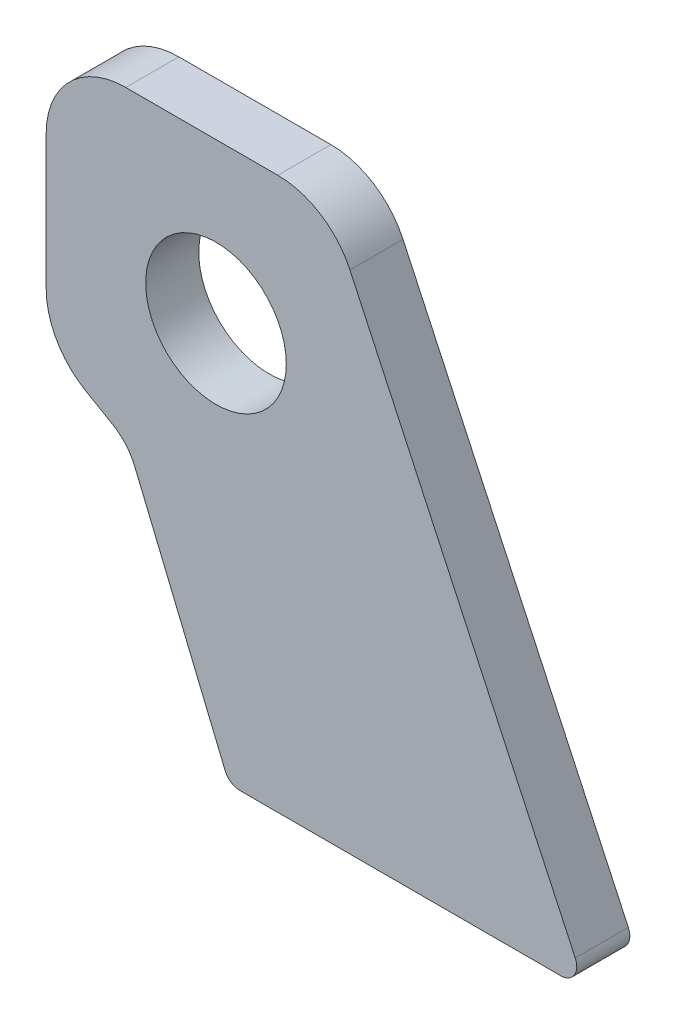
ISO-10303-21;
HEADER;
FILE_DESCRIPTION(('STEP AP214'),'2;1');
FILE_NAME('part.step','',(''),(''),'','','');
FILE_SCHEMA(('AUTOMOTIVE_DESIGN { 1 0 10303 214 1 1 1 1 }'));
ENDSEC;
DATA;
#1=APPLICATION_CONTEXT('core data for automotive mechanical design processes');
#2=APPLICATION_PROTOCOL_DEFINITION('international standard','automotive_design',2000,#1);
#3=PRODUCT_CONTEXT('',#1,'mechanical');
#4=PRODUCT('Part','Part','',(#3));
#5=PRODUCT_RELATED_PRODUCT_CATEGORY('part','',(#4));
#6=PRODUCT_DEFINITION_FORMATION('','',#4);
#7=PRODUCT_DEFINITION_CONTEXT('part definition',#1,'design');
#8=PRODUCT_DEFINITION('design','',#6,#7);
#9=PRODUCT_DEFINITION_SHAPE('','',#8);
#10=(LENGTH_UNIT() NAMED_UNIT(*) SI_UNIT(.MILLI.,.METRE.));
#11=(NAMED_UNIT(*) PLANE_ANGLE_UNIT() SI_UNIT($,.RADIAN.));
#12=(NAMED_UNIT(*) SI_UNIT($,.STERADIAN.) SOLID_ANGLE_UNIT());
#13=UNCERTAINTY_MEASURE_WITH_UNIT(LENGTH_MEASURE(1.E-05),#10,'distance_accuracy_value','');
#14=(GEOMETRIC_REPRESENTATION_CONTEXT(3) GLOBAL_UNCERTAINTY_ASSIGNED_CONTEXT((#13)) GLOBAL_UNIT_ASSIGNED_CONTEXT((#10,
#11,#12)) REPRESENTATION_CONTEXT('',''));
#15=CARTESIAN_POINT('',(0.,0.,0.));
#16=DIRECTION('',(0.,0.,1.));
#17=DIRECTION('',(1.,0.,0.));
#18=AXIS2_PLACEMENT_3D('',#15,#16,#17);
#19=CARTESIAN_POINT('',(-17.,14.9999999930106,10.));
#20=DIRECTION('',(0.,0.,1.));
#21=DIRECTION('',(1.,0.,0.));
#22=AXIS2_PLACEMENT_3D('',#19,#20,#21);
#23=PLANE('',#22);
#24=CARTESIAN_POINT('',(-17.,14.9999999930106,10.));
#25=DIRECTION('',(0.,0.,1.));
#26=DIRECTION('',(1.,0.,0.));
#27=AXIS2_PLACEMENT_3D('',#24,#25,#26);
#28=CIRCLE('',#27,15.);
#29=CARTESIAN_POINT('',(-17.,29.9999999930105,10.));
#30=VERTEX_POINT('',#29);
#31=CARTESIAN_POINT('',(-32.,14.9999999930106,10.));
#32=VERTEX_POINT('',#31);
#33=EDGE_CURVE('E183',#30,#32,#28,.T.);
#34=ORIENTED_EDGE('',*,*,#33,.T.);
#35=DIRECTION('',(0.,-1.,0.));
#36=VECTOR('',#35,1.);
#37=CARTESIAN_POINT('',(-32.,-10.339745969145,10.));
#38=LINE('',#37,#36);
#39=CARTESIAN_POINT('',(-32.,-10.339745969145,10.));
#40=VERTEX_POINT('',#39);
#41=EDGE_CURVE('E111',#32,#40,#38,.T.);
#42=ORIENTED_EDGE('',*,*,#41,.T.);
#43=CARTESIAN_POINT('',(-17.,-10.339745969145,10.));
#44=DIRECTION('',(0.,0.,1.));
#45=DIRECTION('',(-1.,0.,0.));
#46=AXIS2_PLACEMENT_3D('',#43,#44,#45);
#47=CIRCLE('',#46,15.);
#48=CARTESIAN_POINT('',(-24.5,-23.3301270259116,10.));
#49=VERTEX_POINT('',#48);
#50=EDGE_CURVE('E210',#40,#49,#47,.T.);
#51=ORIENTED_EDGE('',*,*,#50,.T.);
#52=DIRECTION('',(0.86602540378444,-0.499999999999997,0.));
#53=VECTOR('',#52,1.);
#54=CARTESIAN_POINT('',(-19.5383048123464,-26.1947630781402,10.));
#55=LINE('',#54,#53);
#56=CARTESIAN_POINT('',(-19.5383048123464,-26.1947630781403,10.));
#57=VERTEX_POINT('',#56);
#58=EDGE_CURVE('E229',#49,#57,#55,.T.);
#59=ORIENTED_EDGE('',*,*,#58,.T.);
#60=CARTESIAN_POINT('',(-24.5383048123464,-34.8550171159847,10.));
#61=DIRECTION('',(0.,0.,-1.));
#62=DIRECTION('',(-1.,0.,0.));
#63=AXIS2_PLACEMENT_3D('',#60,#61,#62);
#64=CIRCLE('',#63,10.);
#65=CARTESIAN_POINT('',(-15.2995094872336,-31.0281827923336,10.));
#66=VERTEX_POINT('',#65);
#67=EDGE_CURVE('E226',#57,#66,#64,.T.);
#68=ORIENTED_EDGE('',*,*,#67,.T.);
#69=DIRECTION('',(0.382683432365102,-0.923879532511282,0.));
#70=VECTOR('',#69,1.);
#71=CARTESIAN_POINT('',(1.73289731622402,-72.1480502970953,10.));
#72=LINE('',#71,#70);
#73=CARTESIAN_POINT('',(1.73289731622403,-72.1480502970953,10.));
#74=VERTEX_POINT('',#73);
#75=EDGE_CURVE('E228',#66,#74,#72,.T.);
#76=ORIENTED_EDGE('',*,*,#75,.T.);
#77=CARTESIAN_POINT('',(4.5045359137579,-71.,10.));
#78=DIRECTION('',(0.,0.,1.));
#79=DIRECTION('',(-1.,0.,0.));
#80=AXIS2_PLACEMENT_3D('',#77,#78,#79);
#81=CIRCLE('',#80,3.00000000000003);
#82=CARTESIAN_POINT('',(4.50453591375787,-74.,10.));
#83=VERTEX_POINT('',#82);
#84=EDGE_CURVE('E231',#74,#83,#81,.T.);
#85=ORIENTED_EDGE('',*,*,#84,.T.);
#86=DIRECTION('',(1.,0.,0.));
#87=VECTOR('',#86,1.);
#88=CARTESIAN_POINT('',(65.,-74.,10.));
#89=LINE('',#88,#87);
#90=CARTESIAN_POINT('',(65.,-74.,10.));
#91=VERTEX_POINT('',#90);
#92=EDGE_CURVE('E237',#83,#91,#89,.T.);
#93=ORIENTED_EDGE('',*,*,#92,.T.);
#94=CARTESIAN_POINT('',(65.,-71.,10.));
#95=DIRECTION('',(0.,0.,1.));
#96=DIRECTION('',(-1.,0.,0.));
#97=AXIS2_PLACEMENT_3D('',#94,#95,#96);
#98=CIRCLE('',#97,2.99999999999999);
#99=CARTESIAN_POINT('',(67.7189233611099,-69.7321452147779,10.));
#100=VERTEX_POINT('',#99);
#101=EDGE_CURVE('E142',#91,#100,#98,.T.);
#102=ORIENTED_EDGE('',*,*,#101,.T.);
#103=DIRECTION('',(-0.422618261740704,0.906307787036648,0.));
#104=VECTOR('',#103,1.);
#105=CARTESIAN_POINT('',(25.2516231799286,21.3392739191211,10.));
#106=LINE('',#105,#104);
#107=CARTESIAN_POINT('',(25.2516231799286,21.3392739191211,10.));
#108=VERTEX_POINT('',#107);
#109=EDGE_CURVE('E136',#100,#108,#106,.T.);
#110=ORIENTED_EDGE('',*,*,#109,.T.);
#111=CARTESIAN_POINT('',(11.6570063743789,14.9999999930106,10.));
#112=DIRECTION('',(0.,0.,1.));
#113=DIRECTION('',(-1.,0.,0.));
#114=AXIS2_PLACEMENT_3D('',#111,#112,#113);
#115=CIRCLE('',#114,15.);
#116=CARTESIAN_POINT('',(11.6570063743789,29.9999999930105,10.));
#117=VERTEX_POINT('',#116);
#118=EDGE_CURVE('E140',#108,#117,#115,.T.);
#119=ORIENTED_EDGE('',*,*,#118,.T.);
#120=DIRECTION('',(-1.,0.,0.));
#121=VECTOR('',#120,1.);
#122=CARTESIAN_POINT('',(-17.,29.9999999930105,10.));
#123=LINE('',#122,#121);
#124=EDGE_CURVE('E56',#117,#30,#123,.T.);
#125=ORIENTED_EDGE('',*,*,#124,.T.);
#126=EDGE_LOOP('',(#34,#42,#51,#59,#68,#76,#85,#93,#102,#110,#119,#125));
#127=FACE_BOUND('',#126,.T.);
#128=CARTESIAN_POINT('',(0.,0.,10.));
#129=DIRECTION('',(0.,0.,1.));
#130=DIRECTION('',(1.,0.,0.));
#131=AXIS2_PLACEMENT_3D('',#128,#129,#130);
#132=CIRCLE('',#131,13.25);
#133=CARTESIAN_POINT('',(13.25,0.,10.));
#134=VERTEX_POINT('',#133);
#135=EDGE_CURVE('E164',#134,#134,#132,.T.);
#136=ORIENTED_EDGE('',*,*,#135,.F.);
#137=EDGE_LOOP('',(#136));
#138=FACE_BOUND('',#137,.T.);
#139=ADVANCED_FACE('F39',(#127,#138),#23,.T.);
#140=CARTESIAN_POINT('',(-17.,14.9999999930106,0.));
#141=DIRECTION('',(0.,0.,1.));
#142=DIRECTION('',(1.,0.,0.));
#143=AXIS2_PLACEMENT_3D('',#140,#141,#142);
#144=PLANE('',#143);
#145=CARTESIAN_POINT('',(-17.,14.9999999930106,0.));
#146=DIRECTION('',(0.,0.,1.));
#147=DIRECTION('',(1.,0.,0.));
#148=AXIS2_PLACEMENT_3D('',#145,#146,#147);
#149=CIRCLE('',#148,15.);
#150=CARTESIAN_POINT('',(-17.,29.9999999930105,0.));
#151=VERTEX_POINT('',#150);
#152=CARTESIAN_POINT('',(-32.,14.9999999930106,0.));
#153=VERTEX_POINT('',#152);
#154=EDGE_CURVE('E160',#151,#153,#149,.T.);
#155=ORIENTED_EDGE('',*,*,#154,.F.);
#156=DIRECTION('',(-1.,0.,0.));
#157=VECTOR('',#156,1.);
#158=CARTESIAN_POINT('',(-17.,29.9999999930105,0.));
#159=LINE('',#158,#157);
#160=CARTESIAN_POINT('',(11.6570063743789,29.9999999930105,0.));
#161=VERTEX_POINT('',#160);
#162=EDGE_CURVE('E103',#161,#151,#159,.T.);
#163=ORIENTED_EDGE('',*,*,#162,.F.);
#164=CARTESIAN_POINT('',(11.6570063743789,14.9999999930106,0.));
#165=DIRECTION('',(0.,0.,1.));
#166=DIRECTION('',(-1.,0.,0.));
#167=AXIS2_PLACEMENT_3D('',#164,#165,#166);
#168=CIRCLE('',#167,15.);
#169=CARTESIAN_POINT('',(25.2516231799286,21.3392739191211,0.));
#170=VERTEX_POINT('',#169);
#171=EDGE_CURVE('E97',#170,#161,#168,.T.);
#172=ORIENTED_EDGE('',*,*,#171,.F.);
#173=DIRECTION('',(-0.422618261740704,0.906307787036648,0.));
#174=VECTOR('',#173,1.);
#175=CARTESIAN_POINT('',(25.2516231799286,21.3392739191211,0.));
#176=LINE('',#175,#174);
#177=CARTESIAN_POINT('',(67.7189233611099,-69.7321452147779,0.));
#178=VERTEX_POINT('',#177);
#179=EDGE_CURVE('E150',#178,#170,#176,.T.);
#180=ORIENTED_EDGE('',*,*,#179,.F.);
#181=CARTESIAN_POINT('',(65.,-71.,0.));
#182=DIRECTION('',(0.,0.,1.));
#183=DIRECTION('',(-1.,0.,0.));
#184=AXIS2_PLACEMENT_3D('',#181,#182,#183);
#185=CIRCLE('',#184,2.99999999999999);
#186=CARTESIAN_POINT('',(65.,-74.,0.));
#187=VERTEX_POINT('',#186);
#188=EDGE_CURVE('E178',#187,#178,#185,.T.);
#189=ORIENTED_EDGE('',*,*,#188,.F.);
#190=DIRECTION('',(1.,0.,0.));
#191=VECTOR('',#190,1.);
#192=CARTESIAN_POINT('',(65.,-74.,0.));
#193=LINE('',#192,#191);
#194=CARTESIAN_POINT('',(4.50453591375787,-74.,0.));
#195=VERTEX_POINT('',#194);
#196=EDGE_CURVE('E176',#195,#187,#193,.T.);
#197=ORIENTED_EDGE('',*,*,#196,.F.);
#198=CARTESIAN_POINT('',(4.5045359137579,-71.,0.));
#199=DIRECTION('',(0.,0.,1.));
#200=DIRECTION('',(-1.,0.,0.));
#201=AXIS2_PLACEMENT_3D('',#198,#199,#200);
#202=CIRCLE('',#201,3.00000000000003);
#203=CARTESIAN_POINT('',(1.73289731622403,-72.1480502970953,0.));
#204=VERTEX_POINT('',#203);
#205=EDGE_CURVE('E174',#204,#195,#202,.T.);
#206=ORIENTED_EDGE('',*,*,#205,.F.);
#207=DIRECTION('',(0.382683432365102,-0.923879532511282,0.));
#208=VECTOR('',#207,1.);
#209=CARTESIAN_POINT('',(1.73289731622402,-72.1480502970953,0.));
#210=LINE('',#209,#208);
#211=CARTESIAN_POINT('',(-15.2995094872336,-31.0281827923336,0.));
#212=VERTEX_POINT('',#211);
#213=EDGE_CURVE('E172',#212,#204,#210,.T.);
#214=ORIENTED_EDGE('',*,*,#213,.F.);
#215=CARTESIAN_POINT('',(-24.5383048123464,-34.8550171159847,0.));
#216=DIRECTION('',(0.,0.,-1.));
#217=DIRECTION('',(-1.,0.,0.));
#218=AXIS2_PLACEMENT_3D('',#215,#216,#217);
#219=CIRCLE('',#218,10.);
#220=CARTESIAN_POINT('',(-19.5383048123464,-26.1947630781403,0.));
#221=VERTEX_POINT('',#220);
#222=EDGE_CURVE('E170',#221,#212,#219,.T.);
#223=ORIENTED_EDGE('',*,*,#222,.F.);
#224=DIRECTION('',(0.86602540378444,-0.499999999999997,0.));
#225=VECTOR('',#224,1.);
#226=CARTESIAN_POINT('',(-19.5383048123464,-26.1947630781402,0.));
#227=LINE('',#226,#225);
#228=CARTESIAN_POINT('',(-24.5,-23.3301270259116,0.));
#229=VERTEX_POINT('',#228);
#230=EDGE_CURVE('E168',#229,#221,#227,.T.);
#231=ORIENTED_EDGE('',*,*,#230,.F.);
#232=CARTESIAN_POINT('',(-17.,-10.339745969145,0.));
#233=DIRECTION('',(0.,0.,1.));
#234=DIRECTION('',(-1.,0.,0.));
#235=AXIS2_PLACEMENT_3D('',#232,#233,#234);
#236=CIRCLE('',#235,15.);
#237=CARTESIAN_POINT('',(-32.,-10.339745969145,0.));
#238=VERTEX_POINT('',#237);
#239=EDGE_CURVE('E166',#238,#229,#236,.T.);
#240=ORIENTED_EDGE('',*,*,#239,.F.);
#241=DIRECTION('',(0.,-1.,0.));
#242=VECTOR('',#241,1.);
#243=CARTESIAN_POINT('',(-32.,-10.339745969145,0.));
#244=LINE('',#243,#242);
#245=EDGE_CURVE('E163',#153,#238,#244,.T.);
#246=ORIENTED_EDGE('',*,*,#245,.F.);
#247=EDGE_LOOP('',(#155,#163,#172,#180,#189,#197,#206,#214,#223,#231,#240,#246));
#248=FACE_BOUND('',#247,.T.);
#249=CARTESIAN_POINT('',(0.,0.,0.));
#250=DIRECTION('',(0.,0.,1.));
#251=DIRECTION('',(1.,0.,0.));
#252=AXIS2_PLACEMENT_3D('',#249,#250,#251);
#253=CIRCLE('',#252,13.25);
#254=CARTESIAN_POINT('',(13.25,0.,0.));
#255=VERTEX_POINT('',#254);
#256=EDGE_CURVE('E354',#255,#255,#253,.T.);
#257=ORIENTED_EDGE('',*,*,#256,.T.);
#258=EDGE_LOOP('',(#257));
#259=FACE_BOUND('',#258,.T.);
#260=ADVANCED_FACE('F214',(#248,#259),#144,.F.);
#261=CARTESIAN_POINT('',(-17.,14.9999999930106,10.));
#262=DIRECTION('',(0.,0.,-1.));
#263=DIRECTION('',(-1.,0.,0.));
#264=AXIS2_PLACEMENT_3D('',#261,#262,#263);
#265=CYLINDRICAL_SURFACE('',#264,15.);
#266=ORIENTED_EDGE('',*,*,#154,.T.);
#267=DIRECTION('',(0.,0.,-1.));
#268=VECTOR('',#267,1.);
#269=CARTESIAN_POINT('',(-32.,14.9999999930106,10.));
#270=LINE('',#269,#268);
#271=EDGE_CURVE('E11',#32,#153,#270,.T.);
#272=ORIENTED_EDGE('',*,*,#271,.F.);
#273=ORIENTED_EDGE('',*,*,#33,.F.);
#274=DIRECTION('',(0.,0.,-1.));
#275=VECTOR('',#274,1.);
#276=CARTESIAN_POINT('',(-17.,29.9999999930105,10.));
#277=LINE('',#276,#275);
#278=EDGE_CURVE('E156',#30,#151,#277,.T.);
#279=ORIENTED_EDGE('',*,*,#278,.T.);
#280=EDGE_LOOP('',(#266,#272,#273,#279));
#281=FACE_BOUND('',#280,.T.);
#282=ADVANCED_FACE('F41',(#281),#265,.T.);
#283=CARTESIAN_POINT('',(-32.,-10.339745969145,10.));
#284=DIRECTION('',(1.,0.,0.));
#285=DIRECTION('',(0.,1.,0.));
#286=AXIS2_PLACEMENT_3D('',#283,#284,#285);
#287=PLANE('',#286);
#288=ORIENTED_EDGE('',*,*,#245,.T.);
#289=DIRECTION('',(0.,0.,-1.));
#290=VECTOR('',#289,1.);
#291=CARTESIAN_POINT('',(-32.,-10.339745969145,10.));
#292=LINE('',#291,#290);
#293=EDGE_CURVE('E48',#40,#238,#292,.T.);
#294=ORIENTED_EDGE('',*,*,#293,.F.);
#295=ORIENTED_EDGE('',*,*,#41,.F.);
#296=ORIENTED_EDGE('',*,*,#271,.T.);
#297=EDGE_LOOP('',(#288,#294,#295,#296));
#298=FACE_BOUND('',#297,.T.);
#299=ADVANCED_FACE('F271',(#298),#287,.F.);
#300=CARTESIAN_POINT('',(-17.,-10.339745969145,10.));
#301=DIRECTION('',(0.,0.,-1.));
#302=DIRECTION('',(-1.,0.,0.));
#303=AXIS2_PLACEMENT_3D('',#300,#301,#302);
#304=CYLINDRICAL_SURFACE('',#303,15.);
#305=ORIENTED_EDGE('',*,*,#239,.T.);
#306=DIRECTION('',(0.,0.,-1.));
#307=VECTOR('',#306,1.);
#308=CARTESIAN_POINT('',(-24.5,-23.3301270259116,10.));
#309=LINE('',#308,#307);
#310=EDGE_CURVE('E202',#49,#229,#309,.T.);
#311=ORIENTED_EDGE('',*,*,#310,.F.);
#312=ORIENTED_EDGE('',*,*,#50,.F.);
#313=ORIENTED_EDGE('',*,*,#293,.T.);
#314=EDGE_LOOP('',(#305,#311,#312,#313));
#315=FACE_BOUND('',#314,.T.);
#316=ADVANCED_FACE('F208',(#315),#304,.T.);
#317=CARTESIAN_POINT('',(-19.5383048123464,-26.1947630781402,10.));
#318=DIRECTION('',(0.499999999999997,0.86602540378444,0.));
#319=DIRECTION('',(-0.86602540378444,0.499999999999997,0.));
#320=AXIS2_PLACEMENT_3D('',#317,#318,#319);
#321=PLANE('',#320);
#322=ORIENTED_EDGE('',*,*,#230,.T.);
#323=DIRECTION('',(0.,0.,-1.));
#324=VECTOR('',#323,1.);
#325=CARTESIAN_POINT('',(-19.5383048123464,-26.1947630781403,10.));
#326=LINE('',#325,#324);
#327=EDGE_CURVE('E199',#57,#221,#326,.T.);
#328=ORIENTED_EDGE('',*,*,#327,.F.);
#329=ORIENTED_EDGE('',*,*,#58,.F.);
#330=ORIENTED_EDGE('',*,*,#310,.T.);
#331=EDGE_LOOP('',(#322,#328,#329,#330));
#332=FACE_BOUND('',#331,.T.);
#333=ADVANCED_FACE('F220',(#332),#321,.F.);
#334=CARTESIAN_POINT('',(-24.5383048123464,-34.8550171159847,10.));
#335=DIRECTION('',(0.,0.,-1.));
#336=DIRECTION('',(-1.,0.,0.));
#337=AXIS2_PLACEMENT_3D('',#334,#335,#336);
#338=CYLINDRICAL_SURFACE('',#337,10.);
#339=ORIENTED_EDGE('',*,*,#222,.T.);
#340=DIRECTION('',(0.,0.,-1.));
#341=VECTOR('',#340,1.);
#342=CARTESIAN_POINT('',(-15.2995094872336,-31.0281827923336,10.));
#343=LINE('',#342,#341);
#344=EDGE_CURVE('E196',#66,#212,#343,.T.);
#345=ORIENTED_EDGE('',*,*,#344,.F.);
#346=ORIENTED_EDGE('',*,*,#67,.F.);
#347=ORIENTED_EDGE('',*,*,#327,.T.);
#348=EDGE_LOOP('',(#339,#345,#346,#347));
#349=FACE_BOUND('',#348,.T.);
#350=ADVANCED_FACE('F224',(#349),#338,.F.);
#351=CARTESIAN_POINT('',(1.73289731622402,-72.1480502970953,10.));
#352=DIRECTION('',(0.923879532511282,0.382683432365102,0.));
#353=DIRECTION('',(-0.382683432365102,0.923879532511282,0.));
#354=AXIS2_PLACEMENT_3D('',#351,#352,#353);
#355=PLANE('',#354);
#356=ORIENTED_EDGE('',*,*,#213,.T.);
#357=DIRECTION('',(0.,0.,-1.));
#358=VECTOR('',#357,1.);
#359=CARTESIAN_POINT('',(1.73289731622403,-72.1480502970953,10.));
#360=LINE('',#359,#358);
#361=EDGE_CURVE('E193',#74,#204,#360,.T.);
#362=ORIENTED_EDGE('',*,*,#361,.F.);
#363=ORIENTED_EDGE('',*,*,#75,.F.);
#364=ORIENTED_EDGE('',*,*,#344,.T.);
#365=EDGE_LOOP('',(#356,#362,#363,#364));
#366=FACE_BOUND('',#365,.T.);
#367=ADVANCED_FACE('F284',(#366),#355,.F.);
#368=CARTESIAN_POINT('',(4.5045359137579,-71.,10.));
#369=DIRECTION('',(0.,0.,-1.));
#370=DIRECTION('',(-1.,0.,0.));
#371=AXIS2_PLACEMENT_3D('',#368,#369,#370);
#372=CYLINDRICAL_SURFACE('',#371,3.00000000000003);
#373=ORIENTED_EDGE('',*,*,#205,.T.);
#374=DIRECTION('',(0.,0.,-1.));
#375=VECTOR('',#374,1.);
#376=CARTESIAN_POINT('',(4.50453591375787,-74.,10.));
#377=LINE('',#376,#375);
#378=EDGE_CURVE('E190',#83,#195,#377,.T.);
#379=ORIENTED_EDGE('',*,*,#378,.F.);
#380=ORIENTED_EDGE('',*,*,#84,.F.);
#381=ORIENTED_EDGE('',*,*,#361,.T.);
#382=EDGE_LOOP('',(#373,#379,#380,#381));
#383=FACE_BOUND('',#382,.T.);
#384=ADVANCED_FACE('F287',(#383),#372,.T.);
#385=CARTESIAN_POINT('',(65.,-74.,10.));
#386=DIRECTION('',(0.,1.,0.));
#387=DIRECTION('',(-1.,0.,0.));
#388=AXIS2_PLACEMENT_3D('',#385,#386,#387);
#389=PLANE('',#388);
#390=ORIENTED_EDGE('',*,*,#196,.T.);
#391=DIRECTION('',(0.,0.,-1.));
#392=VECTOR('',#391,1.);
#393=CARTESIAN_POINT('',(65.,-74.,10.));
#394=LINE('',#393,#392);
#395=EDGE_CURVE('E187',#91,#187,#394,.T.);
#396=ORIENTED_EDGE('',*,*,#395,.F.);
#397=ORIENTED_EDGE('',*,*,#92,.F.);
#398=ORIENTED_EDGE('',*,*,#378,.T.);
#399=EDGE_LOOP('',(#390,#396,#397,#398));
#400=FACE_BOUND('',#399,.T.);
#401=ADVANCED_FACE('F243',(#400),#389,.F.);
#402=CARTESIAN_POINT('',(65.,-71.,10.));
#403=DIRECTION('',(0.,0.,-1.));
#404=DIRECTION('',(-1.,0.,0.));
#405=AXIS2_PLACEMENT_3D('',#402,#403,#404);
#406=CYLINDRICAL_SURFACE('',#405,2.99999999999999);
#407=ORIENTED_EDGE('',*,*,#188,.T.);
#408=DIRECTION('',(0.,0.,-1.));
#409=VECTOR('',#408,1.);
#410=CARTESIAN_POINT('',(67.7189233611099,-69.7321452147779,10.));
#411=LINE('',#410,#409);
#412=EDGE_CURVE('E151',#100,#178,#411,.T.);
#413=ORIENTED_EDGE('',*,*,#412,.F.);
#414=ORIENTED_EDGE('',*,*,#101,.F.);
#415=ORIENTED_EDGE('',*,*,#395,.T.);
#416=EDGE_LOOP('',(#407,#413,#414,#415));
#417=FACE_BOUND('',#416,.T.);
#418=ADVANCED_FACE('F247',(#417),#406,.T.);
#419=CARTESIAN_POINT('',(25.2516231799286,21.3392739191211,10.));
#420=DIRECTION('',(-0.906307787036648,-0.422618261740704,0.));
#421=DIRECTION('',(0.422618261740704,-0.906307787036648,0.));
#422=AXIS2_PLACEMENT_3D('',#419,#420,#421);
#423=PLANE('',#422);
#424=ORIENTED_EDGE('',*,*,#179,.T.);
#425=DIRECTION('',(0.,0.,-1.));
#426=VECTOR('',#425,1.);
#427=CARTESIAN_POINT('',(25.2516231799286,21.3392739191211,10.));
#428=LINE('',#427,#426);
#429=EDGE_CURVE('E147',#108,#170,#428,.T.);
#430=ORIENTED_EDGE('',*,*,#429,.F.);
#431=ORIENTED_EDGE('',*,*,#109,.F.);
#432=ORIENTED_EDGE('',*,*,#412,.T.);
#433=EDGE_LOOP('',(#424,#430,#431,#432));
#434=FACE_BOUND('',#433,.T.);
#435=ADVANCED_FACE('F148',(#434),#423,.F.);
#436=CARTESIAN_POINT('',(11.6570063743789,14.9999999930106,10.));
#437=DIRECTION('',(0.,0.,-1.));
#438=DIRECTION('',(-1.,0.,0.));
#439=AXIS2_PLACEMENT_3D('',#436,#437,#438);
#440=CYLINDRICAL_SURFACE('',#439,15.);
#441=ORIENTED_EDGE('',*,*,#171,.T.);
#442=DIRECTION('',(0.,0.,-1.));
#443=VECTOR('',#442,1.);
#444=CARTESIAN_POINT('',(11.6570063743789,29.9999999930105,10.));
#445=LINE('',#444,#443);
#446=EDGE_CURVE('E152',#117,#161,#445,.T.);
#447=ORIENTED_EDGE('',*,*,#446,.F.);
#448=ORIENTED_EDGE('',*,*,#118,.F.);
#449=ORIENTED_EDGE('',*,*,#429,.T.);
#450=EDGE_LOOP('',(#441,#447,#448,#449));
#451=FACE_BOUND('',#450,.T.);
#452=ADVANCED_FACE('F154',(#451),#440,.T.);
#453=CARTESIAN_POINT('',(-17.,29.9999999930105,10.));
#454=DIRECTION('',(0.,-1.,0.));
#455=DIRECTION('',(0.,0.,-1.));
#456=AXIS2_PLACEMENT_3D('',#453,#454,#455);
#457=PLANE('',#456);
#458=ORIENTED_EDGE('',*,*,#162,.T.);
#459=ORIENTED_EDGE('',*,*,#278,.F.);
#460=ORIENTED_EDGE('',*,*,#124,.F.);
#461=ORIENTED_EDGE('',*,*,#446,.T.);
#462=EDGE_LOOP('',(#458,#459,#460,#461));
#463=FACE_BOUND('',#462,.T.);
#464=ADVANCED_FACE('F251',(#463),#457,.F.);
#465=CARTESIAN_POINT('',(0.,0.,10.));
#466=DIRECTION('',(0.,0.,-1.));
#467=DIRECTION('',(-1.,0.,0.));
#468=AXIS2_PLACEMENT_3D('',#465,#466,#467);
#469=CYLINDRICAL_SURFACE('',#468,13.25);
#470=ORIENTED_EDGE('',*,*,#135,.T.);
#471=EDGE_LOOP('',(#470));
#472=FACE_BOUND('',#471,.T.);
#473=ORIENTED_EDGE('',*,*,#256,.F.);
#474=EDGE_LOOP('',(#473));
#475=FACE_BOUND('',#474,.T.);
#476=ADVANCED_FACE('F253',(#472,#475),#469,.F.);
#477=CLOSED_SHELL('',(#139,#260,#282,#299,#316,#333,#350,#367,#384,#401,#418,#435,#452,#464,#476));
#478=MANIFOLD_SOLID_BREP('B2',#477);
#479=ADVANCED_BREP_SHAPE_REPRESENTATION('',(#18,#478),#14);
#480=SHAPE_DEFINITION_REPRESENTATION(#9,#479);
ENDSEC;
END-ISO-10303-21;
